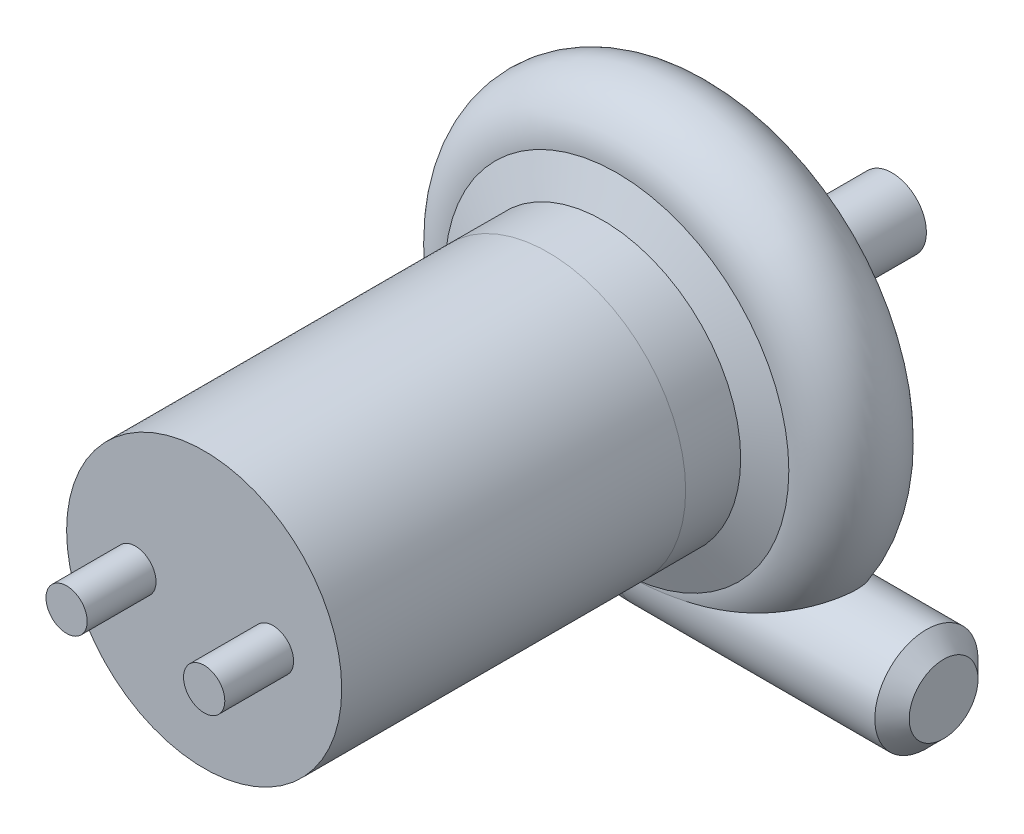
ISO-10303-21;
HEADER;
FILE_DESCRIPTION(('STEP AP214'),'2;1');
FILE_NAME('part.step','',(''),(''),'','','');
FILE_SCHEMA(('AUTOMOTIVE_DESIGN { 1 0 10303 214 1 1 1 1 }'));
ENDSEC;
DATA;
#1=APPLICATION_CONTEXT('core data for automotive mechanical design processes');
#2=APPLICATION_PROTOCOL_DEFINITION('international standard','automotive_design',2000,#1);
#3=PRODUCT_CONTEXT('',#1,'mechanical');
#4=PRODUCT('Part','Part','',(#3));
#5=PRODUCT_RELATED_PRODUCT_CATEGORY('part','',(#4));
#6=PRODUCT_DEFINITION_FORMATION('','',#4);
#7=PRODUCT_DEFINITION_CONTEXT('part definition',#1,'design');
#8=PRODUCT_DEFINITION('design','',#6,#7);
#9=PRODUCT_DEFINITION_SHAPE('','',#8);
#10=(LENGTH_UNIT() NAMED_UNIT(*) SI_UNIT(.MILLI.,.METRE.));
#11=(NAMED_UNIT(*) PLANE_ANGLE_UNIT() SI_UNIT($,.RADIAN.));
#12=(NAMED_UNIT(*) SI_UNIT($,.STERADIAN.) SOLID_ANGLE_UNIT());
#13=UNCERTAINTY_MEASURE_WITH_UNIT(LENGTH_MEASURE(1.E-05),#10,'distance_accuracy_value','');
#14=(GEOMETRIC_REPRESENTATION_CONTEXT(3) GLOBAL_UNCERTAINTY_ASSIGNED_CONTEXT((#13)) GLOBAL_UNIT_ASSIGNED_CONTEXT((#10,
#11,#12)) REPRESENTATION_CONTEXT('',''));
#15=CARTESIAN_POINT('',(0.,0.,0.));
#16=DIRECTION('',(0.,0.,1.));
#17=DIRECTION('',(1.,0.,0.));
#18=AXIS2_PLACEMENT_3D('',#15,#16,#17);
#19=CARTESIAN_POINT('',(0.,0.,-17.5));
#20=DIRECTION('',(0.,0.,1.));
#21=DIRECTION('',(1.,0.,0.));
#22=AXIS2_PLACEMENT_3D('',#19,#20,#21);
#23=TOROIDAL_SURFACE('',#22,25.,7.5);
#24=CARTESIAN_POINT('',(0.,-24.9999999999999,-10.));
#25=CARTESIAN_POINT('',(0.0745358700242135,-25.00000000394,-10.0000000208345));
#26=CARTESIAN_POINT('',(0.149071709978397,-24.999833331914,-9.99999999930643));
#27=CARTESIAN_POINT('',(0.288738204035992,-24.9992087226584,-10.0000000318367));
#28=CARTESIAN_POINT('',(0.353869035964022,-24.9987901857537,-10.0000000767013));
#29=CARTESIAN_POINT('',(0.479387213899455,-24.9977383467193,-10.0000003248749));
#30=CARTESIAN_POINT('',(0.539774708087992,-24.9971228973628,-10.0000005164114));
#31=CARTESIAN_POINT('',(0.620843075850873,-24.9961498163374,-10.0000009842933));
#32=CARTESIAN_POINT('',(0.641525150399207,-24.9958887322939,-10.0000011220743));
#33=CARTESIAN_POINT('',(0.744934966714121,-24.9945191577277,-10.0000019216453));
#34=CARTESIAN_POINT('',(0.827660322971098,-24.9932182124585,-10.0000029154295));
#35=CARTESIAN_POINT('',(0.923899103726816,-24.9914659316114,-10.0000048512384));
#36=CARTESIAN_POINT('',(0.937416335074791,-24.9912143331322,-10.0000051410286));
#37=CARTESIAN_POINT('',(1.00500202455811,-24.9899289439559,-10.0000066929726));
#38=CARTESIAN_POINT('',(1.05906888103837,-24.988812966504,-10.0000082641005));
#39=CARTESIAN_POINT('',(1.32939860638168,-24.9827946769176,-10.0000181200427));
#40=CARTESIAN_POINT('',(1.54563502255638,-24.9765773870699,-10.0000324055509));
#41=CARTESIAN_POINT('',(1.89849185546016,-24.9641441394906,-10.0000843539202));
#42=CARTESIAN_POINT('',(2.03514376368742,-24.9587687180121,-10.0001114863084));
#43=CARTESIAN_POINT('',(2.71836424773379,-24.9290920023375,-10.0002956253573));
#44=CARTESIAN_POINT('',(3.26461021526352,-24.8963985611473,-10.0005980468438));
#45=CARTESIAN_POINT('',(4.02525005280449,-24.8384366067706,-10.0017233591268));
#46=CARTESIAN_POINT('',(4.24024916619323,-24.8206646465934,-10.0021200651048));
#47=CARTESIAN_POINT('',(4.66999014896418,-24.7823735301984,-10.0031334778557));
#48=CARTESIAN_POINT('',(4.88473203392979,-24.761854549879,-10.0037501705464));
#49=CARTESIAN_POINT('',(5.52902599469294,-24.6961449068754,-10.0060287872009));
#50=CARTESIAN_POINT('',(5.95816357010528,-24.6468383711998,-10.0081188244259));
#51=CARTESIAN_POINT('',(6.81505596117058,-24.537385942882,-10.0140806017216));
#52=CARTESIAN_POINT('',(7.24281071559497,-24.477239576788,-10.0179524196267));
#53=CARTESIAN_POINT('',(8.09708172395149,-24.3461989238149,-10.0282620046775));
#54=CARTESIAN_POINT('',(8.52359630153155,-24.2752938979691,-10.0347023462235));
#55=CARTESIAN_POINT('',(9.37468613927719,-24.1229635303758,-10.051062147584));
#56=CARTESIAN_POINT('',(9.7992613571467,-24.0415379603061,-10.0609816829137));
#57=CARTESIAN_POINT('',(10.6495536862222,-23.8676919131025,-10.0854436368342));
#58=CARTESIAN_POINT('',(11.0752529171721,-23.7751889585425,-10.1000222790269));
#59=CARTESIAN_POINT('',(11.9240844665637,-23.5799634410352,-10.1349927507583));
#60=CARTESIAN_POINT('',(12.3472166764294,-23.4772404489697,-10.1553848244581));
#61=CARTESIAN_POINT('',(13.1907648498774,-23.2618170481488,-10.2033633843743));
#62=CARTESIAN_POINT('',(13.6111792864189,-23.1491114783573,-10.2309536065752));
#63=CARTESIAN_POINT('',(14.4486516762625,-22.9141179534083,-10.2948680922935));
#64=CARTESIAN_POINT('',(14.8657097091128,-22.7918302260938,-10.3311921481817));
#65=CARTESIAN_POINT('',(15.6961221631759,-22.5380419370213,-10.4143381671106));
#66=CARTESIAN_POINT('',(16.1094753347445,-22.4065383896001,-10.4611635431903));
#67=CARTESIAN_POINT('',(16.9317517234677,-22.1348481828461,-10.5673104324298));
#68=CARTESIAN_POINT('',(17.3406746345294,-21.9946609279825,-10.626632803308));
#69=CARTESIAN_POINT('',(18.1528946308997,-21.7063717768286,-10.7600277453426));
#70=CARTESIAN_POINT('',(18.5561964647742,-21.5582771449194,-10.8340869429666));
#71=CARTESIAN_POINT('',(19.3564022882135,-21.2548971347508,-10.9996859565341));
#72=CARTESIAN_POINT('',(19.7533075989031,-21.0996132676799,-11.0912221113177));
#73=CARTESIAN_POINT('',(20.5223421226976,-20.7897483857663,-11.2906317909337));
#74=CARTESIAN_POINT('',(20.8948007546543,-20.6354270556811,-11.3976282343288));
#75=CARTESIAN_POINT('',(21.630860067336,-20.3224138031604,-11.6341071426623));
#76=CARTESIAN_POINT('',(21.9944577546651,-20.1637204413071,-11.7635970894804));
#77=CARTESIAN_POINT('',(22.7084226398429,-19.8445420032388,-12.0486783491149));
#78=CARTESIAN_POINT('',(23.0588431463897,-19.6840685736854,-12.2041464628776));
#79=CARTESIAN_POINT('',(23.5725192512051,-19.4436573816285,-12.4610783437608));
#80=CARTESIAN_POINT('',(23.7417013959886,-19.3635950067193,-12.5506457012712));
#81=CARTESIAN_POINT('',(24.0754053642942,-19.2040264987829,-12.7384984172831));
#82=CARTESIAN_POINT('',(24.2399282249346,-19.1245202449823,-12.8367818152196));
#83=CARTESIAN_POINT('',(24.535256746325,-18.9803903465559,-13.0249818786471));
#84=CARTESIAN_POINT('',(24.6669446449604,-18.9155861390085,-13.1133749303796));
#85=CARTESIAN_POINT('',(24.9258966545757,-18.7871643202162,-13.297233139323));
#86=CARTESIAN_POINT('',(25.0531610323279,-18.7235466375224,-13.3926978689665));
#87=CARTESIAN_POINT('',(25.3027093114275,-18.5978849723278,-13.5914488624331));
#88=CARTESIAN_POINT('',(25.4249836780913,-18.5358440808291,-13.6947491120264));
#89=CARTESIAN_POINT('',(25.6633166924132,-18.4140837454527,-13.9096024200341));
#90=CARTESIAN_POINT('',(25.7793752959379,-18.3543643180588,-14.0211555370325));
#91=CARTESIAN_POINT('',(26.0055015463954,-18.2372683442385,-14.254583304171));
#92=CARTESIAN_POINT('',(26.1154721567165,-18.1799321490701,-14.376572902503));
#93=CARTESIAN_POINT('',(26.3262053648205,-18.0694201446025,-14.6301235293924));
#94=CARTESIAN_POINT('',(26.4269663101625,-18.0162450821582,-14.761686268031));
#95=CARTESIAN_POINT('',(26.6170335183861,-17.9154253291347,-15.0342669542109));
#96=CARTESIAN_POINT('',(26.7063732757562,-17.8677645081053,-15.1752553168496));
#97=CARTESIAN_POINT('',(26.8716003314111,-17.7792392126393,-15.4668211168049));
#98=CARTESIAN_POINT('',(26.9474975267289,-17.7383697394813,-15.617391387521));
#99=CARTESIAN_POINT('',(27.1005386644703,-17.6556807001617,-15.9667900101113));
#100=CARTESIAN_POINT('',(27.1731738600251,-17.6162187589654,-16.1682152301728));
#101=CARTESIAN_POINT('',(27.2883783140584,-17.5534779143679,-16.5818729020075));
#102=CARTESIAN_POINT('',(27.3309754823135,-17.5301839888023,-16.7940951246294));
#103=CARTESIAN_POINT('',(27.382627267988,-17.5019243838702,-17.2249763916928));
#104=CARTESIAN_POINT('',(27.391514596637,-17.4970501145064,-17.4436621251517));
#105=CARTESIAN_POINT('',(27.3743941496356,-17.5064260814503,-17.8792524183385));
#106=CARTESIAN_POINT('',(27.3483802033473,-17.5206796996193,-18.0961566562711));
#107=CARTESIAN_POINT('',(27.266573254625,-17.5653546833268,-18.5081482390652));
#108=CARTESIAN_POINT('',(27.2127383698124,-17.5947124352737,-18.7037526053238));
#109=CARTESIAN_POINT('',(27.080392491579,-17.6665672710867,-19.083741640105));
#110=CARTESIAN_POINT('',(27.0018714860644,-17.7090696859963,-19.2681217200476));
#111=CARTESIAN_POINT('',(26.7773096971795,-17.8299389196535,-19.7180084257143));
#112=CARTESIAN_POINT('',(26.6175300507075,-17.9153807529561,-19.9747921669615));
#113=CARTESIAN_POINT('',(26.3523339717247,-18.0556244698605,-20.3359238182531));
#114=CARTESIAN_POINT('',(26.2595003141386,-18.1044797133171,-20.4524721176601));
#115=CARTESIAN_POINT('',(26.0665624964204,-18.2054360404596,-20.6779106880433));
#116=CARTESIAN_POINT('',(25.9664595534013,-18.2575365805712,-20.7868022350251));
#117=CARTESIAN_POINT('',(25.6929093277323,-18.3990338066329,-21.0658505702568));
#118=CARTESIAN_POINT('',(25.5141660340203,-18.4906153258924,-21.2297039448491));
#119=CARTESIAN_POINT('',(25.1438922974827,-18.6781903054189,-21.5394949252319));
#120=CARTESIAN_POINT('',(24.9523530557592,-18.7741867871224,-21.6854200030704));
#121=CARTESIAN_POINT('',(24.5590796574551,-18.9689033668313,-21.9614384475418));
#122=CARTESIAN_POINT('',(24.3573305834314,-19.067627348454,-22.0915076434975));
#123=CARTESIAN_POINT('',(23.9458858855802,-19.2663690455813,-22.3374032092911));
#124=CARTESIAN_POINT('',(23.7361872111979,-19.3663872478276,-22.4532240376297));
#125=CARTESIAN_POINT('',(23.3132624306006,-19.5653592330789,-22.6706965541602));
#126=CARTESIAN_POINT('',(23.1001206170437,-19.6643094307591,-22.7725165501188));
#127=CARTESIAN_POINT('',(22.6687541039716,-19.8617411031024,-22.9650987616475));
#128=CARTESIAN_POINT('',(22.4505300768769,-19.9602226377203,-23.055862430275));
#129=CARTESIAN_POINT('',(22.0096016747759,-20.1562607855709,-23.2275811971658));
#130=CARTESIAN_POINT('',(21.7868934545219,-20.2538164893816,-23.3085274193308));
#131=CARTESIAN_POINT('',(21.3378112619517,-20.4474827262844,-23.4615262644376));
#132=CARTESIAN_POINT('',(21.1114368452219,-20.5435930814076,-23.5335777999048));
#133=CARTESIAN_POINT('',(20.4268640484269,-20.8295150395788,-23.737960990549));
#134=CARTESIAN_POINT('',(19.9639080736412,-21.0166090128684,-23.8582588256161));
#135=CARTESIAN_POINT('',(19.0286535551902,-21.3812916742843,-24.0726377452669));
#136=CARTESIAN_POINT('',(18.5563583579795,-21.558883685582,-24.1667280446148));
#137=CARTESIAN_POINT('',(17.5081237355533,-21.9379278164239,-24.3502999833556));
#138=CARTESIAN_POINT('',(16.9304856500218,-22.1369719381236,-24.4350280883187));
#139=CARTESIAN_POINT('',(15.7664409254578,-22.5175830272275,-24.5801856937636));
#140=CARTESIAN_POINT('',(15.1800326024171,-22.6991465870209,-24.6406104638882));
#141=CARTESIAN_POINT('',(14.0009172108618,-23.0432142561323,-24.742452801684));
#142=CARTESIAN_POINT('',(13.4082196815954,-23.2057436875385,-24.7838958405426));
#143=CARTESIAN_POINT('',(12.2170292107166,-23.5109894087061,-24.8523659241783));
#144=CARTESIAN_POINT('',(11.6185369745138,-23.6537080784507,-24.8793947017359));
#145=CARTESIAN_POINT('',(10.2945630656483,-23.9454465260247,-24.9272490815804));
#146=CARTESIAN_POINT('',(9.56797874178938,-24.0898583767233,-24.9456996953432));
#147=CARTESIAN_POINT('',(8.1092742053239,-24.347715264414,-24.9727058453552));
#148=CARTESIAN_POINT('',(7.37715488080866,-24.4611651652541,-24.9812629364735));
#149=CARTESIAN_POINT('',(6.18558520491175,-24.6194779680621,-24.9905842490635));
#150=CARTESIAN_POINT('',(5.72741872091812,-24.674072149064,-24.993070289967));
#151=CARTESIAN_POINT('',(4.80978783376518,-24.7707642410756,-24.99665263493));
#152=CARTESIAN_POINT('',(4.35032350925872,-24.8128628936156,-24.9977490214693));
#153=CARTESIAN_POINT('',(3.3304700338129,-24.8922140039989,-24.9993536920412));
#154=CARTESIAN_POINT('',(2.76984009420202,-24.9264267815617,-24.9996824690604));
#155=CARTESIAN_POINT('',(1.87899780941725,-24.9657818003373,-24.99993468926));
#156=CARTESIAN_POINT('',(1.54904561956704,-24.9770937969916,-24.9999693386701));
#157=CARTESIAN_POINT('',(1.03164514860658,-24.9897081471481,-24.9999943284513));
#158=CARTESIAN_POINT('',(0.844249949984215,-24.9932236381433,-24.9999973477186));
#159=CARTESIAN_POINT('',(0.512435904176486,-24.9975826252404,-24.9999998465525));
#160=CARTESIAN_POINT('',(0.368022627157253,-24.9988541452583,-24.9999999793792));
#161=CARTESIAN_POINT('',(0.149071622323371,-24.9998333353277,-24.9999999853741));
#162=CARTESIAN_POINT('',(0.07453576700516,-25.0000000092565,-24.9999999530864));
#163=CARTESIAN_POINT('',(0.,-24.9999999999999,-25.));
#164=B_SPLINE_CURVE_WITH_KNOTS('',3,(#24,#25,#26,#27,#28,#29,#30,#31,#32,#33,#34,#35,#36,#37,
#38,#39,#40,#41,#42,#43,#44,#45,#46,#47,#48,#49,#50,#51,#52,#53,#54,#55,#56,#57,#58,#59,#60,#61,
#62,#63,#64,#65,#66,#67,#68,#69,#70,#71,#72,#73,#74,#75,#76,#77,#78,#79,#80,#81,#82,#83,#84,#85,
#86,#87,#88,#89,#90,#91,#92,#93,#94,#95,#96,#97,#98,#99,#100,#101,#102,#103,#104,#105,#106,#107,
#108,#109,#110,#111,#112,#113,#114,#115,#116,#117,#118,#119,#120,#121,#122,#123,#124,#125,#126,
#127,#128,#129,#130,#131,#132,#133,#134,#135,#136,#137,#138,#139,#140,#141,#142,#143,#144,#145,
#146,#147,#148,#149,#150,#151,#152,#153,#154,#155,#156,#157,#158,#159,#160,#161,#162,#163),
.UNSPECIFIED.,.F.,.F.,(4,2,2,2,2,2,2,2,2,2,2,2,2,2,2,2,2,2,2,2,2,2,2,2,2,2,2,2,2,2,2,2,2,2,2,2,
2,2,2,2,2,2,2,2,2,2,2,2,2,2,2,2,2,2,2,2,2,2,2,2,2,2,2,2,2,2,2,2,2,4),(0.,0.223607356766369,
0.419003404956726,0.600174843234931,0.662226011014002,0.910431398407516,0.950990114070947,
1.11322517664204,1.76217821046391,2.17245045148679,3.8137449573035,4.46093248918738,
5.10807859990788,6.40382300941715,7.69962402693108,8.99672708737076,10.2938583029244,
11.601330362073,12.9088573424752,14.2170643105354,15.5252401816918,16.8338418414703,
18.1425333450528,19.4500425955153,20.7572782423671,22.008015506371,23.2591695950521,
24.5045503710726,25.1268536391397,25.7490172811531,26.2628330623986,26.7766178026512,
27.2913422233357,27.8060702982083,28.3274635527545,28.8489501752059,29.3688705454888,
29.8884065206927,30.5389098013232,31.1888078688068,31.8419269386401,32.4951614968745,
33.1076616647413,33.7204105690357,34.6575278653887,35.1276955506,35.5977846952622,
36.3741279158304,37.1510105814301,37.929063096569,38.7074172629245,39.4753950407732,
40.2432717794124,41.0118376716794,41.7804974368276,43.3202167851223,44.8593940712823,
46.7088824474638,48.5587306307152,50.4060892162017,52.2532256752158,54.4755367367273,
56.6974984916428,58.0815843817711,59.465588118731,61.1502601295938,62.1406389834669,
62.7029119434132,63.1361629782986,63.3597703350649),.UNSPECIFIED.);
#165=CARTESIAN_POINT('',(0.,-24.9999999999999,-25.));
#166=VERTEX_POINT('',#165);
#167=CARTESIAN_POINT('',(0.,-24.9999999999999,-10.));
#168=VERTEX_POINT('',#167);
#169=EDGE_CURVE('E109',#166,#168,#164,.F.);
#170=ORIENTED_EDGE('',*,*,#169,.F.);
#171=CARTESIAN_POINT('',(0.,0.,-25.));
#172=DIRECTION('',(0.,0.,1.));
#173=DIRECTION('',(1.,0.,0.));
#174=AXIS2_PLACEMENT_3D('',#171,#172,#173);
#175=CIRCLE('',#174,25.);
#176=EDGE_CURVE('E63',#166,#166,#175,.T.);
#177=ORIENTED_EDGE('',*,*,#176,.T.);
#178=CARTESIAN_POINT('',(0.,-24.9999999999999,-17.5));
#179=DIRECTION('',(1.,0.,0.));
#180=DIRECTION('',(0.,0.,-1.));
#181=AXIS2_PLACEMENT_3D('',#178,#179,#180);
#182=CIRCLE('',#181,7.5);
#183=EDGE_CURVE('E59',#168,#166,#182,.T.);
#184=ORIENTED_EDGE('',*,*,#183,.F.);
#185=CARTESIAN_POINT('',(0.,0.,-10.));
#186=DIRECTION('',(0.,0.,1.));
#187=DIRECTION('',(1.,0.,0.));
#188=AXIS2_PLACEMENT_3D('',#185,#186,#187);
#189=CIRCLE('',#188,25.);
#190=EDGE_CURVE('E67',#168,#168,#189,.T.);
#191=ORIENTED_EDGE('',*,*,#190,.F.);
#192=EDGE_LOOP('',(#170,#177,#184,#191));
#193=FACE_BOUND('',#192,.T.);
#194=ADVANCED_FACE('F44',(#193),#23,.T.);
#195=CARTESIAN_POINT('',(0.,0.,0.));
#196=DIRECTION('',(0.,0.,-1.));
#197=DIRECTION('',(-1.,0.,0.));
#198=AXIS2_PLACEMENT_3D('',#195,#196,#197);
#199=PLANE('',#198);
#200=CARTESIAN_POINT('',(0.,0.,0.));
#201=DIRECTION('',(0.,0.,1.));
#202=DIRECTION('',(1.,0.,0.));
#203=AXIS2_PLACEMENT_3D('',#200,#201,#202);
#204=CIRCLE('',#203,20.);
#205=CARTESIAN_POINT('',(20.,0.,0.));
#206=VERTEX_POINT('',#205);
#207=EDGE_CURVE('E79',#206,#206,#204,.T.);
#208=ORIENTED_EDGE('',*,*,#207,.T.);
#209=EDGE_LOOP('',(#208));
#210=FACE_BOUND('',#209,.T.);
#211=ADVANCED_FACE('F95',(#210),#199,.F.);
#212=CARTESIAN_POINT('',(0.,0.,0.));
#213=DIRECTION('',(0.,0.,1.));
#214=DIRECTION('',(1.,0.,0.));
#215=AXIS2_PLACEMENT_3D('',#212,#213,#214);
#216=CYLINDRICAL_SURFACE('',#215,20.);
#217=ORIENTED_EDGE('',*,*,#207,.F.);
#218=EDGE_LOOP('',(#217));
#219=FACE_BOUND('',#218,.T.);
#220=CARTESIAN_POINT('',(0.,2.77555756156289E-13,-8.00000000000001));
#221=DIRECTION('',(0.,0.,1.));
#222=DIRECTION('',(1.,0.,0.));
#223=AXIS2_PLACEMENT_3D('',#220,#221,#222);
#224=CIRCLE('',#223,20.);
#225=CARTESIAN_POINT('',(20.,2.72004641033163E-13,-8.));
#226=VERTEX_POINT('',#225);
#227=EDGE_CURVE('E70',#226,#226,#224,.T.);
#228=ORIENTED_EDGE('',*,*,#227,.T.);
#229=EDGE_LOOP('',(#228));
#230=FACE_BOUND('',#229,.T.);
#231=ADVANCED_FACE('F100',(#219,#230),#216,.T.);
#232=CARTESIAN_POINT('',(0.,0.,-10.));
#233=DIRECTION('',(0.,0.,-1.));
#234=DIRECTION('',(-1.,0.,0.));
#235=AXIS2_PLACEMENT_3D('',#232,#233,#234);
#236=CONICAL_SURFACE('',#235,25.,1.19028994968253);
#237=ORIENTED_EDGE('',*,*,#227,.F.);
#238=EDGE_LOOP('',(#237));
#239=FACE_BOUND('',#238,.T.);
#240=ORIENTED_EDGE('',*,*,#190,.T.);
#241=EDGE_LOOP('',(#240));
#242=FACE_BOUND('',#241,.T.);
#243=ADVANCED_FACE('F106',(#239,#242),#236,.T.);
#244=CARTESIAN_POINT('',(0.,25.,-24.9999999999997));
#245=DIRECTION('',(0.,0.,1.));
#246=DIRECTION('',(1.,0.,0.));
#247=AXIS2_PLACEMENT_3D('',#244,#245,#246);
#248=PLANE('',#247);
#249=ORIENTED_EDGE('',*,*,#176,.F.);
#250=EDGE_LOOP('',(#249));
#251=FACE_BOUND('',#250,.T.);
#252=CARTESIAN_POINT('',(0.,0.,-25.));
#253=DIRECTION('',(0.,0.,1.));
#254=DIRECTION('',(1.,0.,0.));
#255=AXIS2_PLACEMENT_3D('',#252,#253,#254);
#256=CIRCLE('',#255,15.);
#257=CARTESIAN_POINT('',(15.,0.,-25.));
#258=VERTEX_POINT('',#257);
#259=EDGE_CURVE('E68',#258,#258,#256,.T.);
#260=ORIENTED_EDGE('',*,*,#259,.T.);
#261=EDGE_LOOP('',(#260));
#262=FACE_BOUND('',#261,.T.);
#263=ADVANCED_FACE('F64',(#251,#262),#248,.F.);
#264=CARTESIAN_POINT('',(0.,0.,-35.));
#265=DIRECTION('',(0.,0.,1.));
#266=DIRECTION('',(1.,0.,0.));
#267=AXIS2_PLACEMENT_3D('',#264,#265,#266);
#268=CONICAL_SURFACE('',#267,10.,0.463647609000806);
#269=ORIENTED_EDGE('',*,*,#259,.F.);
#270=EDGE_LOOP('',(#269));
#271=FACE_BOUND('',#270,.T.);
#272=CARTESIAN_POINT('',(0.,0.,-35.));
#273=DIRECTION('',(0.,0.,1.));
#274=DIRECTION('',(1.,0.,0.));
#275=AXIS2_PLACEMENT_3D('',#272,#273,#274);
#276=CIRCLE('',#275,10.);
#277=CARTESIAN_POINT('',(10.,0.,-35.));
#278=VERTEX_POINT('',#277);
#279=EDGE_CURVE('E73',#278,#278,#276,.T.);
#280=ORIENTED_EDGE('',*,*,#279,.T.);
#281=EDGE_LOOP('',(#280));
#282=FACE_BOUND('',#281,.T.);
#283=ADVANCED_FACE('F134',(#271,#282),#268,.T.);
#284=CARTESIAN_POINT('',(0.,10.,-35.));
#285=DIRECTION('',(0.,0.,1.));
#286=DIRECTION('',(1.,0.,0.));
#287=AXIS2_PLACEMENT_3D('',#284,#285,#286);
#288=PLANE('',#287);
#289=ORIENTED_EDGE('',*,*,#279,.F.);
#290=EDGE_LOOP('',(#289));
#291=FACE_BOUND('',#290,.T.);
#292=CARTESIAN_POINT('',(0.,0.,-35.));
#293=DIRECTION('',(0.,0.,1.));
#294=DIRECTION('',(1.,0.,0.));
#295=AXIS2_PLACEMENT_3D('',#292,#293,#294);
#296=CIRCLE('',#295,5.);
#297=CARTESIAN_POINT('',(5.,0.,-35.));
#298=VERTEX_POINT('',#297);
#299=EDGE_CURVE('E145',#298,#298,#296,.T.);
#300=ORIENTED_EDGE('',*,*,#299,.T.);
#301=EDGE_LOOP('',(#300));
#302=FACE_BOUND('',#301,.T.);
#303=ADVANCED_FACE('F131',(#291,#302),#288,.F.);
#304=CARTESIAN_POINT('',(0.,0.,0.));
#305=DIRECTION('',(0.,0.,1.));
#306=DIRECTION('',(1.,0.,0.));
#307=AXIS2_PLACEMENT_3D('',#304,#305,#306);
#308=CYLINDRICAL_SURFACE('',#307,5.);
#309=ORIENTED_EDGE('',*,*,#299,.F.);
#310=EDGE_LOOP('',(#309));
#311=FACE_BOUND('',#310,.T.);
#312=CARTESIAN_POINT('',(0.,0.,-50.));
#313=DIRECTION('',(0.,0.,1.));
#314=DIRECTION('',(1.,0.,0.));
#315=AXIS2_PLACEMENT_3D('',#312,#313,#314);
#316=CIRCLE('',#315,5.);
#317=CARTESIAN_POINT('',(5.,0.,-50.));
#318=VERTEX_POINT('',#317);
#319=EDGE_CURVE('E118',#318,#318,#316,.T.);
#320=ORIENTED_EDGE('',*,*,#319,.T.);
#321=EDGE_LOOP('',(#320));
#322=FACE_BOUND('',#321,.T.);
#323=ADVANCED_FACE('F127',(#311,#322),#308,.T.);
#324=CARTESIAN_POINT('',(0.,0.,-50.));
#325=DIRECTION('',(0.,0.,1.));
#326=DIRECTION('',(1.,0.,0.));
#327=AXIS2_PLACEMENT_3D('',#324,#325,#326);
#328=PLANE('',#327);
#329=ORIENTED_EDGE('',*,*,#319,.F.);
#330=EDGE_LOOP('',(#329));
#331=FACE_BOUND('',#330,.T.);
#332=ADVANCED_FACE('F123',(#331),#328,.F.);
#333=CARTESIAN_POINT('',(40.0000000000001,-24.9999999999999,-17.5));
#334=DIRECTION('',(-1.,0.,0.));
#335=DIRECTION('',(0.,0.,1.));
#336=AXIS2_PLACEMENT_3D('',#333,#334,#335);
#337=CYLINDRICAL_SURFACE('',#336,7.5);
#338=CARTESIAN_POINT('',(37.5000000000001,-24.9999999999999,-17.5));
#339=DIRECTION('',(1.,0.,0.));
#340=DIRECTION('',(0.,0.,-1.));
#341=AXIS2_PLACEMENT_3D('',#338,#339,#340);
#342=CIRCLE('',#341,7.5);
#343=CARTESIAN_POINT('',(37.5000000000001,-24.9999999999999,-25.));
#344=VERTEX_POINT('',#343);
#345=EDGE_CURVE('E12',#344,#344,#342,.F.);
#346=ORIENTED_EDGE('',*,*,#345,.T.);
#347=EDGE_LOOP('',(#346));
#348=FACE_BOUND('',#347,.T.);
#349=ORIENTED_EDGE('',*,*,#183,.T.);
#350=ORIENTED_EDGE('',*,*,#169,.T.);
#351=EDGE_LOOP('',(#349,#350));
#352=FACE_BOUND('',#351,.T.);
#353=ADVANCED_FACE('F91',(#348,#352),#337,.T.);
#354=CARTESIAN_POINT('',(40.0000000000001,-24.9999999999999,-17.5));
#355=DIRECTION('',(1.,0.,0.));
#356=DIRECTION('',(0.,0.,-1.));
#357=AXIS2_PLACEMENT_3D('',#354,#355,#356);
#358=PLANE('',#357);
#359=CARTESIAN_POINT('',(40.0000000000001,-24.9999999999999,-17.5));
#360=DIRECTION('',(1.,0.,0.));
#361=DIRECTION('',(0.,0.,-1.));
#362=AXIS2_PLACEMENT_3D('',#359,#360,#361);
#363=CIRCLE('',#362,5.);
#364=CARTESIAN_POINT('',(40.0000000000001,-24.9999999999999,-22.5));
#365=VERTEX_POINT('',#364);
#366=EDGE_CURVE('E52',#365,#365,#363,.T.);
#367=ORIENTED_EDGE('',*,*,#366,.T.);
#368=EDGE_LOOP('',(#367));
#369=FACE_BOUND('',#368,.T.);
#370=ADVANCED_FACE('F84',(#369),#358,.T.);
#371=CARTESIAN_POINT('',(40.0000000000001,-24.9999999999999,-17.5));
#372=DIRECTION('',(-1.,0.,0.));
#373=DIRECTION('',(0.,0.,1.));
#374=AXIS2_PLACEMENT_3D('',#371,#372,#373);
#375=CONICAL_SURFACE('',#374,5.,0.785398163397446);
#376=ORIENTED_EDGE('',*,*,#345,.F.);
#377=EDGE_LOOP('',(#376));
#378=FACE_BOUND('',#377,.T.);
#379=ORIENTED_EDGE('',*,*,#366,.F.);
#380=EDGE_LOOP('',(#379));
#381=FACE_BOUND('',#380,.T.);
#382=ADVANCED_FACE('F46',(#378,#381),#375,.T.);
#383=CLOSED_SHELL('',(#194,#211,#231,#243,#263,#283,#303,#323,#332,#353,#370,#382));
#384=MANIFOLD_SOLID_BREP('B2',#383);
#385=CARTESIAN_POINT('',(0.,2.77555756156289E-13,50.));
#386=DIRECTION('',(0.,0.,-1.));
#387=DIRECTION('',(-1.,0.,0.));
#388=AXIS2_PLACEMENT_3D('',#385,#386,#387);
#389=CYLINDRICAL_SURFACE('',#388,20.);
#390=CARTESIAN_POINT('',(0.,2.77555756156289E-13,50.));
#391=DIRECTION('',(0.,0.,1.));
#392=DIRECTION('',(1.,0.,0.));
#393=AXIS2_PLACEMENT_3D('',#390,#391,#392);
#394=CIRCLE('',#393,20.);
#395=CARTESIAN_POINT('',(20.0000000000001,2.72004641033163E-13,50.));
#396=VERTEX_POINT('',#395);
#397=EDGE_CURVE('E43',#396,#396,#394,.T.);
#398=ORIENTED_EDGE('',*,*,#397,.F.);
#399=EDGE_LOOP('',(#398));
#400=FACE_BOUND('',#399,.T.);
#401=CARTESIAN_POINT('',(0.,0.,0.));
#402=DIRECTION('',(0.,0.,1.));
#403=DIRECTION('',(1.,0.,0.));
#404=AXIS2_PLACEMENT_3D('',#401,#402,#403);
#405=CIRCLE('',#404,20.);
#406=CARTESIAN_POINT('',(20.,0.,0.));
#407=VERTEX_POINT('',#406);
#408=EDGE_CURVE('E232',#407,#407,#405,.T.);
#409=ORIENTED_EDGE('',*,*,#408,.T.);
#410=EDGE_LOOP('',(#409));
#411=FACE_BOUND('',#410,.T.);
#412=ADVANCED_FACE('F229',(#400,#411),#389,.T.);
#413=CARTESIAN_POINT('',(0.,2.77555756156289E-13,50.));
#414=DIRECTION('',(0.,0.,1.));
#415=DIRECTION('',(1.,0.,0.));
#416=AXIS2_PLACEMENT_3D('',#413,#414,#415);
#417=PLANE('',#416);
#418=CARTESIAN_POINT('',(-10.,2.77555756156289E-13,50.));
#419=DIRECTION('',(0.,0.,1.));
#420=DIRECTION('',(1.,0.,0.));
#421=AXIS2_PLACEMENT_3D('',#418,#419,#420);
#422=CIRCLE('',#421,3.);
#423=CARTESIAN_POINT('',(-6.99999999999999,2.7672308888782E-13,50.));
#424=VERTEX_POINT('',#423);
#425=EDGE_CURVE('E247',#424,#424,#422,.T.);
#426=ORIENTED_EDGE('',*,*,#425,.F.);
#427=EDGE_LOOP('',(#426));
#428=FACE_BOUND('',#427,.T.);
#429=CARTESIAN_POINT('',(10.,2.77555756156289E-13,50.));
#430=DIRECTION('',(0.,0.,1.));
#431=DIRECTION('',(1.,0.,0.));
#432=AXIS2_PLACEMENT_3D('',#429,#430,#431);
#433=CIRCLE('',#432,3.);
#434=CARTESIAN_POINT('',(13.,2.7672308888782E-13,50.));
#435=VERTEX_POINT('',#434);
#436=EDGE_CURVE('E241',#435,#435,#433,.T.);
#437=ORIENTED_EDGE('',*,*,#436,.F.);
#438=EDGE_LOOP('',(#437));
#439=FACE_BOUND('',#438,.T.);
#440=ORIENTED_EDGE('',*,*,#397,.T.);
#441=EDGE_LOOP('',(#440));
#442=FACE_BOUND('',#441,.T.);
#443=ADVANCED_FACE('F262',(#428,#439,#442),#417,.T.);
#444=CARTESIAN_POINT('',(0.,0.,0.));
#445=DIRECTION('',(0.,0.,1.));
#446=DIRECTION('',(1.,0.,0.));
#447=AXIS2_PLACEMENT_3D('',#444,#445,#446);
#448=PLANE('',#447);
#449=ORIENTED_EDGE('',*,*,#408,.F.);
#450=EDGE_LOOP('',(#449));
#451=FACE_BOUND('',#450,.T.);
#452=ADVANCED_FACE('F265',(#451),#448,.F.);
#453=CARTESIAN_POINT('',(10.,0.,60.));
#454=DIRECTION('',(0.,0.,-1.));
#455=DIRECTION('',(-1.,0.,0.));
#456=AXIS2_PLACEMENT_3D('',#453,#454,#455);
#457=CYLINDRICAL_SURFACE('',#456,3.);
#458=CARTESIAN_POINT('',(10.,0.,60.));
#459=DIRECTION('',(0.,0.,1.));
#460=DIRECTION('',(1.,0.,0.));
#461=AXIS2_PLACEMENT_3D('',#458,#459,#460);
#462=CIRCLE('',#461,3.);
#463=CARTESIAN_POINT('',(13.,0.,60.));
#464=VERTEX_POINT('',#463);
#465=EDGE_CURVE('E239',#464,#464,#462,.T.);
#466=ORIENTED_EDGE('',*,*,#465,.F.);
#467=EDGE_LOOP('',(#466));
#468=FACE_BOUND('',#467,.T.);
#469=ORIENTED_EDGE('',*,*,#436,.T.);
#470=EDGE_LOOP('',(#469));
#471=FACE_BOUND('',#470,.T.);
#472=ADVANCED_FACE('F269',(#468,#471),#457,.T.);
#473=CARTESIAN_POINT('',(10.,0.,60.));
#474=DIRECTION('',(0.,0.,1.));
#475=DIRECTION('',(1.,0.,0.));
#476=AXIS2_PLACEMENT_3D('',#473,#474,#475);
#477=PLANE('',#476);
#478=ORIENTED_EDGE('',*,*,#465,.T.);
#479=EDGE_LOOP('',(#478));
#480=FACE_BOUND('',#479,.T.);
#481=ADVANCED_FACE('F258',(#480),#477,.T.);
#482=CARTESIAN_POINT('',(-10.,2.77555756156289E-13,60.));
#483=DIRECTION('',(0.,0.,-1.));
#484=DIRECTION('',(-1.,0.,0.));
#485=AXIS2_PLACEMENT_3D('',#482,#483,#484);
#486=CYLINDRICAL_SURFACE('',#485,3.);
#487=CARTESIAN_POINT('',(-10.,2.77555756156289E-13,60.));
#488=DIRECTION('',(0.,0.,1.));
#489=DIRECTION('',(1.,0.,0.));
#490=AXIS2_PLACEMENT_3D('',#487,#488,#489);
#491=CIRCLE('',#490,3.);
#492=CARTESIAN_POINT('',(-6.99999999999999,2.7672308888782E-13,60.));
#493=VERTEX_POINT('',#492);
#494=EDGE_CURVE('E244',#493,#493,#491,.T.);
#495=ORIENTED_EDGE('',*,*,#494,.F.);
#496=EDGE_LOOP('',(#495));
#497=FACE_BOUND('',#496,.T.);
#498=ORIENTED_EDGE('',*,*,#425,.T.);
#499=EDGE_LOOP('',(#498));
#500=FACE_BOUND('',#499,.T.);
#501=ADVANCED_FACE('F255',(#497,#500),#486,.T.);
#502=CARTESIAN_POINT('',(-10.,2.77555756156289E-13,60.));
#503=DIRECTION('',(0.,0.,1.));
#504=DIRECTION('',(1.,0.,0.));
#505=AXIS2_PLACEMENT_3D('',#502,#503,#504);
#506=PLANE('',#505);
#507=ORIENTED_EDGE('',*,*,#494,.T.);
#508=EDGE_LOOP('',(#507));
#509=FACE_BOUND('',#508,.T.);
#510=ADVANCED_FACE('F253',(#509),#506,.T.);
#511=CLOSED_SHELL('',(#412,#443,#452,#472,#481,#501,#510));
#512=MANIFOLD_SOLID_BREP('B6',#511);
#513=ADVANCED_BREP_SHAPE_REPRESENTATION('',(#18,#384,#512),#14);
#514=SHAPE_DEFINITION_REPRESENTATION(#9,#513);
ENDSEC;
END-ISO-10303-21;
